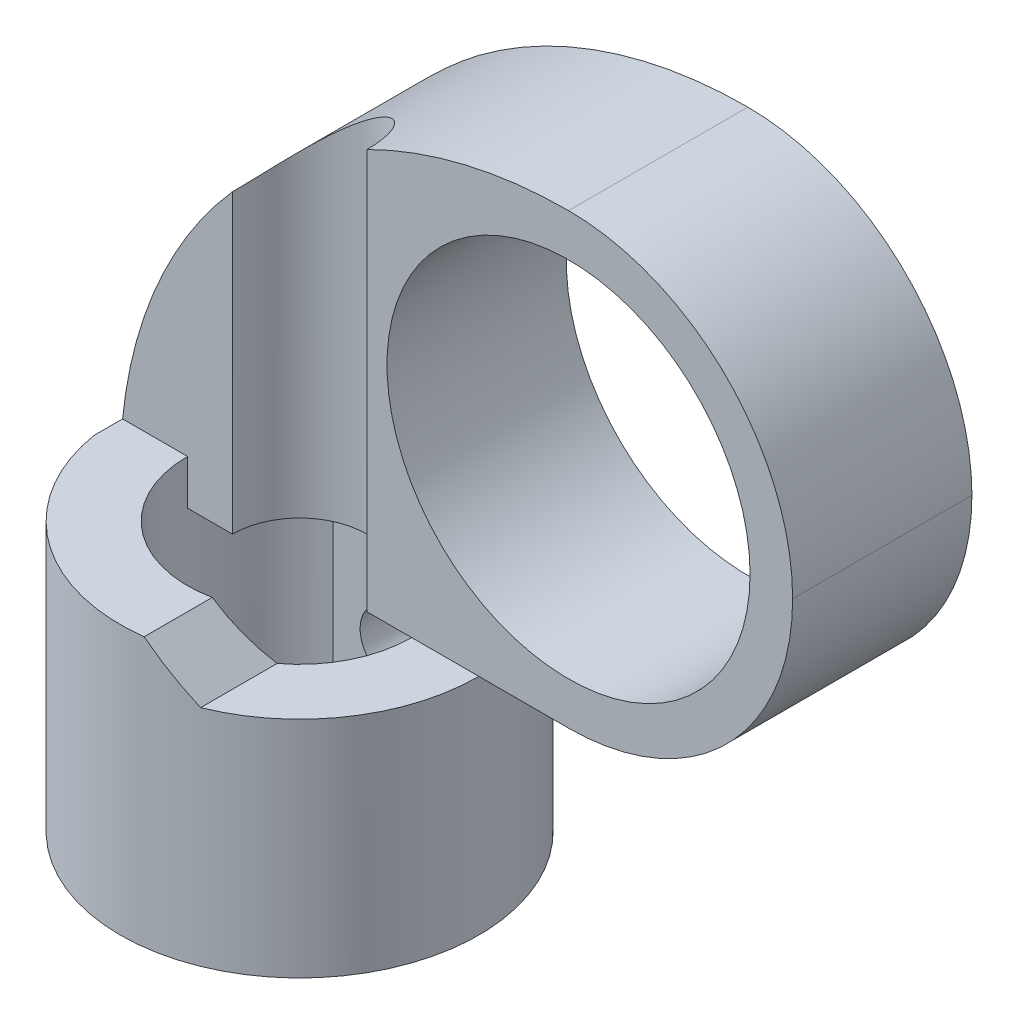
ISO-10303-21;
HEADER;
FILE_DESCRIPTION(('STEP AP214'),'2;1');
FILE_NAME('part.step','',(''),(''),'','','');
FILE_SCHEMA(('AUTOMOTIVE_DESIGN { 1 0 10303 214 1 1 1 1 }'));
ENDSEC;
DATA;
#1=APPLICATION_CONTEXT('core data for automotive mechanical design processes');
#2=APPLICATION_PROTOCOL_DEFINITION('international standard','automotive_design',2000,#1);
#3=PRODUCT_CONTEXT('',#1,'mechanical');
#4=PRODUCT('Part','Part','',(#3));
#5=PRODUCT_RELATED_PRODUCT_CATEGORY('part','',(#4));
#6=PRODUCT_DEFINITION_FORMATION('','',#4);
#7=PRODUCT_DEFINITION_CONTEXT('part definition',#1,'design');
#8=PRODUCT_DEFINITION('design','',#6,#7);
#9=PRODUCT_DEFINITION_SHAPE('','',#8);
#10=(LENGTH_UNIT() NAMED_UNIT(*) SI_UNIT(.MILLI.,.METRE.));
#11=(NAMED_UNIT(*) PLANE_ANGLE_UNIT() SI_UNIT($,.RADIAN.));
#12=(NAMED_UNIT(*) SI_UNIT($,.STERADIAN.) SOLID_ANGLE_UNIT());
#13=UNCERTAINTY_MEASURE_WITH_UNIT(LENGTH_MEASURE(1.E-05),#10,'distance_accuracy_value','');
#14=(GEOMETRIC_REPRESENTATION_CONTEXT(3) GLOBAL_UNCERTAINTY_ASSIGNED_CONTEXT((#13)) GLOBAL_UNIT_ASSIGNED_CONTEXT((#10,
#11,#12)) REPRESENTATION_CONTEXT('',''));
#15=CARTESIAN_POINT('',(0.,0.,0.));
#16=DIRECTION('',(0.,0.,1.));
#17=DIRECTION('',(1.,0.,0.));
#18=AXIS2_PLACEMENT_3D('',#15,#16,#17);
#19=CARTESIAN_POINT('',(0.,6.,0.));
#20=DIRECTION('',(0.,-1.,0.));
#21=DIRECTION('',(0.,0.,-1.));
#22=AXIS2_PLACEMENT_3D('',#19,#20,#21);
#23=CYLINDRICAL_SURFACE('',#22,4.);
#24=CARTESIAN_POINT('',(0.,3.25,-4.));
#25=CARTESIAN_POINT('',(0.0417358732327354,3.24999840520586,-3.99999924416926));
#26=CARTESIAN_POINT('',(0.0834924963650493,3.24650446169031,-3.99934004960857));
#27=CARTESIAN_POINT('',(0.165829064920899,3.23263000244083,-3.9967739294526));
#28=CARTESIAN_POINT('',(0.206407987076113,3.22224367468013,-3.99486595083448));
#29=CARTESIAN_POINT('',(0.285186480925901,3.19491364937033,-3.99001569382729));
#30=CARTESIAN_POINT('',(0.323388165342672,3.17797587377373,-3.98707434973241));
#31=CARTESIAN_POINT('',(0.396403986547003,3.13804056153859,-3.98047855299892));
#32=CARTESIAN_POINT('',(0.431218397238662,3.11504351542759,-3.97682415809145));
#33=CARTESIAN_POINT('',(0.496891857965252,3.06335011599816,-3.96915668215252));
#34=CARTESIAN_POINT('',(0.527704477515917,3.03459527766493,-3.96514017428176));
#35=CARTESIAN_POINT('',(0.584098030676847,2.97232834545622,-3.95722659229325));
#36=CARTESIAN_POINT('',(0.609678588446208,2.93881591011536,-3.95332952677264));
#37=CARTESIAN_POINT('',(0.655074993328965,2.86765695581802,-3.94606275622503));
#38=CARTESIAN_POINT('',(0.674843609848027,2.82997981484138,-3.94269746943091));
#39=CARTESIAN_POINT('',(0.707752621661416,2.75176554241161,-3.93692356605994));
#40=CARTESIAN_POINT('',(0.720893588565492,2.71122865794439,-3.93451486698481));
#41=CARTESIAN_POINT('',(0.740025267517502,2.6289423845428,-3.93096134787275));
#42=CARTESIAN_POINT('',(0.746096950960196,2.58721245139827,-3.92980222683202));
#43=CARTESIAN_POINT('',(0.751169040476733,2.50331130759588,-3.92883598576381));
#44=CARTESIAN_POINT('',(0.750170080676872,2.46114013684885,-3.9290287444938));
#45=CARTESIAN_POINT('',(0.741194898011814,2.37814023736698,-3.93073146350876));
#46=CARTESIAN_POINT('',(0.733310749980226,2.33730114284992,-3.93222404073667));
#47=CARTESIAN_POINT('',(0.710933996981037,2.2575357901087,-3.93633091642333));
#48=CARTESIAN_POINT('',(0.696441111197499,2.21860961324535,-3.93894526254758));
#49=CARTESIAN_POINT('',(0.661168235896501,2.14350566049987,-3.94501927646294));
#50=CARTESIAN_POINT('',(0.640351067662281,2.1073457647096,-3.94848391911683));
#51=CARTESIAN_POINT('',(0.593046844652084,2.03899763572989,-3.95586485801459));
#52=CARTESIAN_POINT('',(0.566559214446332,2.0068098061426,-3.95978120007761));
#53=CARTESIAN_POINT('',(0.508169528426491,1.94678752216377,-3.96770000636082));
#54=CARTESIAN_POINT('',(0.476188718430344,1.91902967377413,-3.97170285512015));
#55=CARTESIAN_POINT('',(0.407984018549416,1.8692613796623,-3.97928693054159));
#56=CARTESIAN_POINT('',(0.371760086127887,1.84725099156479,-3.98286815297622));
#57=CARTESIAN_POINT('',(0.296017494437337,1.80959112306499,-3.98921269838754));
#58=CARTESIAN_POINT('',(0.25649478222325,1.79394961044105,-3.99197499568144));
#59=CARTESIAN_POINT('',(0.175319557699351,1.76954895345392,-3.9963625270136));
#60=CARTESIAN_POINT('',(0.133667272138897,1.76078907797732,-3.99798788183997));
#61=CARTESIAN_POINT('',(0.0500743264516956,1.75050698449087,-3.9999018032099));
#62=CARTESIAN_POINT('',(0.00814700631707065,1.74887980423514,-4.00020975456139));
#63=CARTESIAN_POINT('',(-0.075380624046089,1.75262773977382,-3.99950771799114));
#64=CARTESIAN_POINT('',(-0.11698095024019,1.75800251153263,-3.99849779482216));
#65=CARTESIAN_POINT('',(-0.198340786609106,1.77551451759168,-3.99528555750203));
#66=CARTESIAN_POINT('',(-0.238112130523029,1.78759864126891,-3.99309261187015));
#67=CARTESIAN_POINT('',(-0.315064315912313,1.81812885338939,-3.98775921106249));
#68=CARTESIAN_POINT('',(-0.352244981297549,1.83657537378289,-3.98461869155667));
#69=CARTESIAN_POINT('',(-0.423408335756604,1.87953906407976,-3.97769015178833));
#70=CARTESIAN_POINT('',(-0.457351638507558,1.90412036926842,-3.97389543087281));
#71=CARTESIAN_POINT('',(-0.52066916163227,1.95856906868118,-3.96609671744856));
#72=CARTESIAN_POINT('',(-0.550042954880431,1.98843695650066,-3.96209270542344));
#73=CARTESIAN_POINT('',(-0.603786479360237,2.05308615945571,-3.95426237848725));
#74=CARTESIAN_POINT('',(-0.62808458109288,2.08792745406269,-3.95043912930129));
#75=CARTESIAN_POINT('',(-0.670483375288932,2.16125881226187,-3.94346492789266));
#76=CARTESIAN_POINT('',(-0.688584298069618,2.19974874018524,-3.94031395068675));
#77=CARTESIAN_POINT('',(-0.717973367564113,2.27910293362127,-3.93506512104787));
#78=CARTESIAN_POINT('',(-0.729294343973929,2.31995468977967,-3.93296220218439));
#79=CARTESIAN_POINT('',(-0.744903396631175,2.4030236112607,-3.93003601901208));
#80=CARTESIAN_POINT('',(-0.749192266353539,2.4452406219852,-3.92921261032895));
#81=CARTESIAN_POINT('',(-0.750588810741772,2.52912416572075,-3.92894599901929));
#82=CARTESIAN_POINT('',(-0.747809475017493,2.5707887904785,-3.92948107987147));
#83=CARTESIAN_POINT('',(-0.735395876894013,2.65304571102264,-3.93182300329999));
#84=CARTESIAN_POINT('',(-0.725761655446659,2.69363801321372,-3.93362983827873));
#85=CARTESIAN_POINT('',(-0.699959437916315,2.77253724239774,-3.9383025401159));
#86=CARTESIAN_POINT('',(-0.683803676986261,2.81084829567288,-3.94116642297482));
#87=CARTESIAN_POINT('',(-0.64542934456102,2.88423412712042,-3.9476319377592));
#88=CARTESIAN_POINT('',(-0.623210344740927,2.91930867642239,-3.9512336218006));
#89=CARTESIAN_POINT('',(-0.572947436697675,2.98579184002115,-3.95883633053873));
#90=CARTESIAN_POINT('',(-0.544821299321517,3.01713770628355,-3.96284252676522));
#91=CARTESIAN_POINT('',(-0.483713963371145,3.07470258123226,-3.97076416959368));
#92=CARTESIAN_POINT('',(-0.450731650945807,3.10092041049007,-3.97467959513664));
#93=CARTESIAN_POINT('',(-0.380492472535936,3.14770547631353,-3.98201987984024));
#94=CARTESIAN_POINT('',(-0.343199795320258,3.16821971424532,-3.9854400049528));
#95=CARTESIAN_POINT('',(-0.265645056826917,3.20265881830257,-3.99135809690343));
#96=CARTESIAN_POINT('',(-0.225385825852624,3.21658987352345,-3.99385692939519));
#97=CARTESIAN_POINT('',(-0.154173601412577,3.23463865720934,-3.99714145353816));
#98=CARTESIAN_POINT('',(-0.123636905125935,3.2403893151564,-3.99820735439103));
#99=CARTESIAN_POINT('',(-0.0620706235575788,3.24807053105822,-3.99963689977005));
#100=CARTESIAN_POINT('',(-0.0310410508263547,3.25000118612795,-4.00000056214902));
#101=CARTESIAN_POINT('',(0.,3.25,-4.));
#102=B_SPLINE_CURVE_WITH_KNOTS('',3,(#24,#25,#26,#27,#28,#29,#30,#31,#32,#33,#34,#35,#36,#37,
#38,#39,#40,#41,#42,#43,#44,#45,#46,#47,#48,#49,#50,#51,#52,#53,#54,#55,#56,#57,#58,#59,#60,#61,
#62,#63,#64,#65,#66,#67,#68,#69,#70,#71,#72,#73,#74,#75,#76,#77,#78,#79,#80,#81,#82,#83,#84,#85,
#86,#87,#88,#89,#90,#91,#92,#93,#94,#95,#96,#97,#98,#99,#100,#101),.UNSPECIFIED.,.T.,.F.,(4,2,2,
2,2,2,2,2,2,2,2,2,2,2,2,2,2,2,2,2,2,2,2,2,2,2,2,2,2,2,2,2,2,2,2,2,2,2,4),(0.,0.125094100482462,
0.250293821267726,0.375380635615453,0.500457326684454,0.626875590068153,0.753302931418083,
0.880730952521788,1.00814798155974,1.13409075722668,1.26002223793628,1.38429500306383,
1.50857304923393,1.63359631314765,1.7586322702493,1.88563884232038,2.01264668772474,
2.13981294160849,2.26696568336873,2.39224087038048,2.51750990232292,2.64180116953914,
2.76610087669016,2.89175889008854,3.01742864206549,3.14476718493649,3.27210099477472,
3.39881313909279,3.52551098473256,3.65019626115874,3.77488079270753,3.89933248103846,
4.02379296327711,4.1501168498319,4.27646975631128,4.40396024458157,4.53133063465586,
4.62437172262204,4.7174104451977),.UNSPECIFIED.);
#103=CARTESIAN_POINT('',(0.,3.25,-4.));
#104=VERTEX_POINT('',#103);
#105=EDGE_CURVE('E237',#104,#104,#102,.T.);
#106=ORIENTED_EDGE('',*,*,#105,.F.);
#107=EDGE_LOOP('',(#106));
#108=FACE_BOUND('',#107,.T.);
#109=CARTESIAN_POINT('',(0.,0.,0.));
#110=DIRECTION('',(0.,1.,0.));
#111=DIRECTION('',(0.,0.,1.));
#112=AXIS2_PLACEMENT_3D('',#109,#110,#111);
#113=CIRCLE('',#112,4.);
#114=CARTESIAN_POINT('',(0.,0.,4.));
#115=VERTEX_POINT('',#114);
#116=EDGE_CURVE('E193',#115,#115,#113,.T.);
#117=ORIENTED_EDGE('',*,*,#116,.T.);
#118=EDGE_LOOP('',(#117));
#119=FACE_BOUND('',#118,.T.);
#120=CARTESIAN_POINT('',(0.,5.,0.));
#121=DIRECTION('',(0.,1.,0.));
#122=DIRECTION('',(0.,0.,1.));
#123=AXIS2_PLACEMENT_3D('',#120,#121,#122);
#124=CIRCLE('',#123,4.);
#125=CARTESIAN_POINT('',(1.5,5.,3.70809924354783));
#126=VERTEX_POINT('',#125);
#127=CARTESIAN_POINT('',(4.,5.,0.));
#128=VERTEX_POINT('',#127);
#129=EDGE_CURVE('E134',#126,#128,#124,.T.);
#130=ORIENTED_EDGE('',*,*,#129,.F.);
#131=CARTESIAN_POINT('',(0.,6.5,0.));
#132=DIRECTION('',(-0.707106781186549,-0.707106781186546,0.));
#133=DIRECTION('',(0.707106781186546,-0.707106781186549,0.));
#134=AXIS2_PLACEMENT_3D('',#131,#132,#133);
#135=ELLIPSE('',#134,5.65685424949239,4.);
#136=CARTESIAN_POINT('',(0.5,6.,3.96862696659689));
#137=VERTEX_POINT('',#136);
#138=EDGE_CURVE('E11',#126,#137,#135,.T.);
#139=ORIENTED_EDGE('',*,*,#138,.T.);
#140=CARTESIAN_POINT('',(0.,6.,0.));
#141=DIRECTION('',(0.,1.,0.));
#142=DIRECTION('',(0.,0.,1.));
#143=AXIS2_PLACEMENT_3D('',#140,#141,#142);
#144=CIRCLE('',#143,4.);
#145=CARTESIAN_POINT('',(-3.9498743710662,6.,0.631262586246322));
#146=VERTEX_POINT('',#145);
#147=EDGE_CURVE('E194',#146,#137,#144,.T.);
#148=ORIENTED_EDGE('',*,*,#147,.F.);
#149=CARTESIAN_POINT('',(-3.9498743710662,6.,0.631262586246322));
#150=CARTESIAN_POINT('',(-3.96632277253755,5.83630392232504,0.528319356862075));
#151=CARTESIAN_POINT('',(-3.97871575402529,5.6724313521736,0.424975405116243));
#152=CARTESIAN_POINT('',(-3.99540519007638,5.34466869147848,0.217982730391228));
#153=CARTESIAN_POINT('',(-3.9997087743698,5.18077874380114,0.114334356507499));
#154=CARTESIAN_POINT('',(-3.99999523603248,5.01126870686564,0.00712695582297911));
#155=CARTESIAN_POINT('',(-3.99999999779557,5.00563434305114,0.00356347116541067));
#156=CARTESIAN_POINT('',(-4.,5.,0.));
#157=B_SPLINE_CURVE_WITH_KNOTS('',3,(#149,#150,#151,#152,#153,#154,#155,#156),.UNSPECIFIED.,.F.,
.F.,(4,2,2,4),(0.,0.582212443825408,1.16391150360277,1.18391150870536),.UNSPECIFIED.);
#158=CARTESIAN_POINT('',(-4.,5.,0.));
#159=VERTEX_POINT('',#158);
#160=EDGE_CURVE('E214',#146,#159,#157,.T.);
#161=ORIENTED_EDGE('',*,*,#160,.T.);
#162=CARTESIAN_POINT('',(0.,13.,-4.));
#163=CARTESIAN_POINT('',(-0.136828142349666,12.8974163205105,-3.9999865045483));
#164=CARTESIAN_POINT('',(-0.270883349009091,12.7913558223817,-3.99298316514078));
#165=CARTESIAN_POINT('',(-0.532473742800881,12.573345536025,-3.96657821674277));
#166=CARTESIAN_POINT('',(-0.660019795246988,12.4614062401594,-3.9471980508367));
#167=CARTESIAN_POINT('',(-0.90691673449115,12.2334307682533,-3.89784569202083));
#168=CARTESIAN_POINT('',(-1.02633399292208,12.1174436459312,-3.86797592672533));
#169=CARTESIAN_POINT('',(-1.2579962205929,11.8810530718573,-3.79895536855165));
#170=CARTESIAN_POINT('',(-1.37023693747521,11.7606470670557,-3.75979913664154));
#171=CARTESIAN_POINT('',(-1.63335273219341,11.4642196545002,-3.65511218402422));
#172=CARTESIAN_POINT('',(-1.78042089668579,11.2862713975694,-3.58543920262987));
#173=CARTESIAN_POINT('',(-2.05941788108904,10.9243595245275,-3.43279691235437));
#174=CARTESIAN_POINT('',(-2.19134288412687,10.7403944067991,-3.34982426383159));
#175=CARTESIAN_POINT('',(-2.44098896225458,10.3666096422533,-3.17256045263293));
#176=CARTESIAN_POINT('',(-2.55862453171194,10.1767625402299,-3.07820730054449));
#177=CARTESIAN_POINT('',(-2.77917552112438,9.79322689449993,-2.880642470672));
#178=CARTESIAN_POINT('',(-2.88209066491544,9.59953827880181,-2.77743062675168));
#179=CARTESIAN_POINT('',(-3.11335424297583,9.12812428449467,-2.51956723914358));
#180=CARTESIAN_POINT('',(-3.23456273387307,8.84884356889938,-2.36132688702443));
#181=CARTESIAN_POINT('',(-3.44956780619618,8.28580891102368,-2.03439818807636));
#182=CARTESIAN_POINT('',(-3.543350883079,8.00205283726669,-1.86570474342132));
#183=CARTESIAN_POINT('',(-3.70425021344949,7.43208484915114,-1.52137047053106));
#184=CARTESIAN_POINT('',(-3.77141934042668,7.14587896988863,-1.34574418718945));
#185=CARTESIAN_POINT('',(-3.88003973098983,6.57166812426913,-0.989887224920112));
#186=CARTESIAN_POINT('',(-3.92150459798406,6.28366419115204,-0.809659034125393));
#187=CARTESIAN_POINT('',(-3.96664690227575,5.83231316445596,-0.525804465514074));
#188=CARTESIAN_POINT('',(-3.97891607459805,5.66926692083749,-0.422978469644746));
#189=CARTESIAN_POINT('',(-3.99544488881155,5.34310856296169,-0.216995930114278));
#190=CARTESIAN_POINT('',(-3.99971005306622,5.17999657184071,-0.113839663582856));
#191=CARTESIAN_POINT('',(-3.99999523753145,5.01126870148945,-0.0071269525611572));
#192=CARTESIAN_POINT('',(-3.99999999934633,5.00563433748219,-0.00356346779445476));
#193=CARTESIAN_POINT('',(-4.,4.99999999999999,0.));
#194=B_SPLINE_CURVE_WITH_KNOTS('',3,(#162,#163,#164,#165,#166,#167,#168,#169,#170,#171,#172,
#173,#174,#175,#176,#177,#178,#179,#180,#181,#182,#183,#184,#185,#186,#187,#188,#189,#190,#191,
#192,#193),.UNSPECIFIED.,.F.,.F.,(4,2,2,2,2,2,2,2,2,2,2,2,2,2,2,4),(0.,0.512646840224081,
1.02440791078159,1.53130471589305,2.03849914404044,2.76083094309587,3.48334440980876,
4.20998802285531,4.93664526638483,5.96450394794211,6.99286790824439,8.01917846622402,
9.04494540740961,9.62426733753744,10.2031894174716,10.2231894225741),.UNSPECIFIED.);
#195=CARTESIAN_POINT('',(0.,13.,-4.));
#196=VERTEX_POINT('',#195);
#197=EDGE_CURVE('E270',#159,#196,#194,.F.);
#198=ORIENTED_EDGE('',*,*,#197,.T.);
#199=DIRECTION('',(0.,-1.,0.));
#200=VECTOR('',#199,1.);
#201=CARTESIAN_POINT('',(0.,15.,-4.));
#202=LINE('',#201,#200);
#203=CARTESIAN_POINT('',(0.,5.,-4.));
#204=VERTEX_POINT('',#203);
#205=EDGE_CURVE('E170',#196,#204,#202,.T.);
#206=ORIENTED_EDGE('',*,*,#205,.T.);
#207=CARTESIAN_POINT('',(0.,5.,0.));
#208=DIRECTION('',(0.,1.,0.));
#209=DIRECTION('',(-1.,0.,0.));
#210=AXIS2_PLACEMENT_3D('',#207,#208,#209);
#211=CIRCLE('',#210,4.);
#212=EDGE_CURVE('E162',#128,#204,#211,.T.);
#213=ORIENTED_EDGE('',*,*,#212,.F.);
#214=EDGE_LOOP('',(#130,#139,#148,#161,#198,#206,#213));
#215=FACE_BOUND('',#214,.T.);
#216=ADVANCED_FACE('F38',(#108,#119,#215),#23,.T.);
#217=CARTESIAN_POINT('',(0.,6.,0.));
#218=DIRECTION('',(0.,-1.,0.));
#219=DIRECTION('',(0.,0.,-1.));
#220=AXIS2_PLACEMENT_3D('',#217,#218,#219);
#221=CYLINDRICAL_SURFACE('',#220,2.5);
#222=CARTESIAN_POINT('',(0.,6.,0.));
#223=DIRECTION('',(0.,1.,0.));
#224=DIRECTION('',(0.,0.,1.));
#225=AXIS2_PLACEMENT_3D('',#222,#223,#224);
#226=CIRCLE('',#225,2.5);
#227=CARTESIAN_POINT('',(-2.5,6.,0.));
#228=VERTEX_POINT('',#227);
#229=CARTESIAN_POINT('',(0.5,6.,2.44948974278318));
#230=VERTEX_POINT('',#229);
#231=EDGE_CURVE('E181',#228,#230,#226,.T.);
#232=ORIENTED_EDGE('',*,*,#231,.T.);
#233=CARTESIAN_POINT('',(0.,6.5,0.));
#234=DIRECTION('',(-0.707106781186549,-0.707106781186546,0.));
#235=DIRECTION('',(0.707106781186546,-0.707106781186549,0.));
#236=AXIS2_PLACEMENT_3D('',#233,#234,#235);
#237=ELLIPSE('',#236,3.53553390593274,2.5);
#238=CARTESIAN_POINT('',(1.5,5.,2.));
#239=VERTEX_POINT('',#238);
#240=EDGE_CURVE('E46',#230,#239,#237,.F.);
#241=ORIENTED_EDGE('',*,*,#240,.T.);
#242=CARTESIAN_POINT('',(0.,5.,0.));
#243=DIRECTION('',(0.,1.,0.));
#244=DIRECTION('',(0.,0.,1.));
#245=AXIS2_PLACEMENT_3D('',#242,#243,#244);
#246=CIRCLE('',#245,2.5);
#247=CARTESIAN_POINT('',(2.5,5.,0.));
#248=VERTEX_POINT('',#247);
#249=EDGE_CURVE('E143',#239,#248,#246,.T.);
#250=ORIENTED_EDGE('',*,*,#249,.T.);
#251=CARTESIAN_POINT('',(0.,5.,0.));
#252=DIRECTION('',(0.,1.,0.));
#253=DIRECTION('',(-1.,0.,0.));
#254=AXIS2_PLACEMENT_3D('',#251,#252,#253);
#255=CIRCLE('',#254,2.5);
#256=CARTESIAN_POINT('',(1.35646599662505,5.,-2.1));
#257=VERTEX_POINT('',#256);
#258=EDGE_CURVE('E172',#248,#257,#255,.T.);
#259=ORIENTED_EDGE('',*,*,#258,.T.);
#260=DIRECTION('',(0.,-1.,0.));
#261=VECTOR('',#260,1.);
#262=CARTESIAN_POINT('',(1.35646599662505,6.,-2.1));
#263=LINE('',#262,#261);
#264=CARTESIAN_POINT('',(1.35646599662505,0.,-2.1));
#265=VERTEX_POINT('',#264);
#266=EDGE_CURVE('E191',#257,#265,#263,.T.);
#267=ORIENTED_EDGE('',*,*,#266,.T.);
#268=CARTESIAN_POINT('',(0.,0.,0.));
#269=DIRECTION('',(0.,1.,0.));
#270=DIRECTION('',(0.,0.,1.));
#271=AXIS2_PLACEMENT_3D('',#268,#269,#270);
#272=CIRCLE('',#271,2.5);
#273=CARTESIAN_POINT('',(-1.35646599662505,0.,-2.1));
#274=VERTEX_POINT('',#273);
#275=EDGE_CURVE('E174',#274,#265,#272,.T.);
#276=ORIENTED_EDGE('',*,*,#275,.F.);
#277=DIRECTION('',(0.,-1.,0.));
#278=VECTOR('',#277,1.);
#279=CARTESIAN_POINT('',(-1.35646599662505,6.,-2.1));
#280=LINE('',#279,#278);
#281=CARTESIAN_POINT('',(-1.35646599662505,5.,-2.1));
#282=VERTEX_POINT('',#281);
#283=EDGE_CURVE('E184',#282,#274,#280,.T.);
#284=ORIENTED_EDGE('',*,*,#283,.F.);
#285=CARTESIAN_POINT('',(-2.5,5.,0.));
#286=VERTEX_POINT('',#285);
#287=EDGE_CURVE('E177',#282,#286,#255,.T.);
#288=ORIENTED_EDGE('',*,*,#287,.T.);
#289=DIRECTION('',(0.,-1.,0.));
#290=VECTOR('',#289,1.);
#291=CARTESIAN_POINT('',(-2.5,6.,0.));
#292=LINE('',#291,#290);
#293=EDGE_CURVE('E201',#228,#286,#292,.T.);
#294=ORIENTED_EDGE('',*,*,#293,.F.);
#295=EDGE_LOOP('',(#232,#241,#250,#259,#267,#276,#284,#288,#294));
#296=FACE_BOUND('',#295,.T.);
#297=ADVANCED_FACE('F231',(#296),#221,.F.);
#298=CARTESIAN_POINT('',(0.,6.,0.));
#299=DIRECTION('',(0.,1.,0.));
#300=DIRECTION('',(0.,0.,1.));
#301=AXIS2_PLACEMENT_3D('',#298,#299,#300);
#302=PLANE('',#301);
#303=ORIENTED_EDGE('',*,*,#147,.T.);
#304=DIRECTION('',(0.,0.,-1.));
#305=VECTOR('',#304,1.);
#306=CARTESIAN_POINT('',(0.5,6.,0.));
#307=LINE('',#306,#305);
#308=EDGE_CURVE('E269',#137,#230,#307,.T.);
#309=ORIENTED_EDGE('',*,*,#308,.T.);
#310=ORIENTED_EDGE('',*,*,#231,.F.);
#311=DIRECTION('',(1.,0.,0.));
#312=VECTOR('',#311,1.);
#313=CARTESIAN_POINT('',(0.,6.,0.));
#314=LINE('',#313,#312);
#315=CARTESIAN_POINT('',(-3.9498743710662,6.,0.));
#316=VERTEX_POINT('',#315);
#317=EDGE_CURVE('E171',#316,#228,#314,.T.);
#318=ORIENTED_EDGE('',*,*,#317,.F.);
#319=DIRECTION('',(0.,0.,-1.));
#320=VECTOR('',#319,1.);
#321=CARTESIAN_POINT('',(-3.9498743710662,6.,0.));
#322=LINE('',#321,#320);
#323=EDGE_CURVE('E212',#316,#146,#322,.F.);
#324=ORIENTED_EDGE('',*,*,#323,.T.);
#325=EDGE_LOOP('',(#303,#309,#310,#318,#324));
#326=FACE_BOUND('',#325,.T.);
#327=ADVANCED_FACE('F283',(#326),#302,.T.);
#328=CARTESIAN_POINT('',(0.,0.,0.));
#329=DIRECTION('',(0.,0.,1.));
#330=DIRECTION('',(1.,0.,0.));
#331=AXIS2_PLACEMENT_3D('',#328,#329,#330);
#332=PLANE('',#331);
#333=DIRECTION('',(0.,-1.,0.));
#334=VECTOR('',#333,1.);
#335=CARTESIAN_POINT('',(-1.5,15.,0.));
#336=LINE('',#335,#334);
#337=CARTESIAN_POINT('',(-1.5,11.6143782776615,0.));
#338=VERTEX_POINT('',#337);
#339=CARTESIAN_POINT('',(-1.5,5.,0.));
#340=VERTEX_POINT('',#339);
#341=EDGE_CURVE('E310',#338,#340,#336,.T.);
#342=ORIENTED_EDGE('',*,*,#341,.F.);
#343=CARTESIAN_POINT('',(6.,5.,0.));
#344=DIRECTION('',(0.,0.,1.));
#345=DIRECTION('',(1.,0.,0.));
#346=AXIS2_PLACEMENT_3D('',#343,#344,#345);
#347=CIRCLE('',#346,10.);
#348=EDGE_CURVE('E208',#338,#316,#347,.T.);
#349=ORIENTED_EDGE('',*,*,#348,.T.);
#350=ORIENTED_EDGE('',*,*,#317,.T.);
#351=ORIENTED_EDGE('',*,*,#293,.T.);
#352=DIRECTION('',(1.,0.,0.));
#353=VECTOR('',#352,1.);
#354=CARTESIAN_POINT('',(11.,5.,0.));
#355=LINE('',#354,#353);
#356=EDGE_CURVE('E168',#286,#340,#355,.T.);
#357=ORIENTED_EDGE('',*,*,#356,.T.);
#358=EDGE_LOOP('',(#342,#349,#350,#351,#357));
#359=FACE_BOUND('',#358,.T.);
#360=ADVANCED_FACE('F324',(#359),#332,.T.);
#361=CARTESIAN_POINT('',(-1.35646599662505,6.,-2.1));
#362=DIRECTION('',(0.,0.,1.));
#363=DIRECTION('',(1.,0.,0.));
#364=AXIS2_PLACEMENT_3D('',#361,#362,#363);
#365=PLANE('',#364);
#366=CARTESIAN_POINT('',(0.,2.5,-2.1));
#367=DIRECTION('',(0.,0.,1.));
#368=DIRECTION('',(1.,0.,0.));
#369=AXIS2_PLACEMENT_3D('',#366,#367,#368);
#370=CIRCLE('',#369,0.75);
#371=CARTESIAN_POINT('',(0.750000000000002,2.5,-2.1));
#372=VERTEX_POINT('',#371);
#373=EDGE_CURVE('E142',#372,#372,#370,.F.);
#374=ORIENTED_EDGE('',*,*,#373,.T.);
#375=EDGE_LOOP('',(#374));
#376=FACE_BOUND('',#375,.T.);
#377=ORIENTED_EDGE('',*,*,#266,.F.);
#378=DIRECTION('',(-1.,0.,0.));
#379=VECTOR('',#378,1.);
#380=CARTESIAN_POINT('',(-1.35646599662505,5.,-2.1));
#381=LINE('',#380,#379);
#382=EDGE_CURVE('E196',#257,#282,#381,.T.);
#383=ORIENTED_EDGE('',*,*,#382,.T.);
#384=ORIENTED_EDGE('',*,*,#283,.T.);
#385=DIRECTION('',(-1.,0.,0.));
#386=VECTOR('',#385,1.);
#387=CARTESIAN_POINT('',(-1.35646599662505,0.,-2.1));
#388=LINE('',#387,#386);
#389=EDGE_CURVE('E185',#265,#274,#388,.T.);
#390=ORIENTED_EDGE('',*,*,#389,.F.);
#391=EDGE_LOOP('',(#377,#383,#384,#390));
#392=FACE_BOUND('',#391,.T.);
#393=ADVANCED_FACE('F333',(#376,#392),#365,.T.);
#394=CARTESIAN_POINT('',(0.,0.,0.));
#395=DIRECTION('',(0.,1.,0.));
#396=DIRECTION('',(0.,0.,1.));
#397=AXIS2_PLACEMENT_3D('',#394,#395,#396);
#398=PLANE('',#397);
#399=ORIENTED_EDGE('',*,*,#116,.F.);
#400=EDGE_LOOP('',(#399));
#401=FACE_BOUND('',#400,.T.);
#402=ORIENTED_EDGE('',*,*,#275,.T.);
#403=ORIENTED_EDGE('',*,*,#389,.T.);
#404=EDGE_LOOP('',(#402,#403));
#405=FACE_BOUND('',#404,.T.);
#406=ADVANCED_FACE('F233',(#401,#405),#398,.F.);
#407=CARTESIAN_POINT('',(1.5,5.,0.));
#408=VERTEX_POINT('',#407);
#409=EDGE_CURVE('E154',#408,#248,#355,.T.);
#410=ORIENTED_EDGE('',*,*,#409,.T.);
#411=DIRECTION('',(1.,0.,0.));
#412=VECTOR('',#411,1.);
#413=CARTESIAN_POINT('',(4.,5.,0.));
#414=LINE('',#413,#412);
#415=EDGE_CURVE('E138',#248,#128,#414,.T.);
#416=ORIENTED_EDGE('',*,*,#415,.T.);
#417=CARTESIAN_POINT('',(6.,5.,0.));
#418=VERTEX_POINT('',#417);
#419=EDGE_CURVE('E151',#128,#418,#355,.T.);
#420=ORIENTED_EDGE('',*,*,#419,.T.);
#421=CARTESIAN_POINT('',(6.,10.,0.));
#422=DIRECTION('',(0.,0.,1.));
#423=DIRECTION('',(1.,0.,0.));
#424=AXIS2_PLACEMENT_3D('',#421,#422,#423);
#425=CIRCLE('',#424,5.);
#426=CARTESIAN_POINT('',(11.,10.,0.));
#427=VERTEX_POINT('',#426);
#428=EDGE_CURVE('E292',#418,#427,#425,.T.);
#429=ORIENTED_EDGE('',*,*,#428,.T.);
#430=CARTESIAN_POINT('',(6.,10.,0.));
#431=DIRECTION('',(0.,0.,1.));
#432=DIRECTION('',(1.,0.,0.));
#433=AXIS2_PLACEMENT_3D('',#430,#431,#432);
#434=CIRCLE('',#433,5.);
#435=CARTESIAN_POINT('',(6.,15.,0.));
#436=VERTEX_POINT('',#435);
#437=EDGE_CURVE('E293',#427,#436,#434,.T.);
#438=ORIENTED_EDGE('',*,*,#437,.T.);
#439=CARTESIAN_POINT('',(1.5,13.9302855497459,0.));
#440=VERTEX_POINT('',#439);
#441=EDGE_CURVE('E209',#436,#440,#347,.T.);
#442=ORIENTED_EDGE('',*,*,#441,.T.);
#443=DIRECTION('',(0.,-1.,0.));
#444=VECTOR('',#443,1.);
#445=CARTESIAN_POINT('',(1.5,15.,0.));
#446=LINE('',#445,#444);
#447=EDGE_CURVE('E244',#408,#440,#446,.F.);
#448=ORIENTED_EDGE('',*,*,#447,.F.);
#449=EDGE_LOOP('',(#410,#416,#420,#429,#438,#442,#448));
#450=FACE_BOUND('',#449,.T.);
#451=CARTESIAN_POINT('',(6.,10.,0.));
#452=DIRECTION('',(0.,0.,1.));
#453=DIRECTION('',(1.,0.,0.));
#454=AXIS2_PLACEMENT_3D('',#451,#452,#453);
#455=CIRCLE('',#454,4.05);
#456=CARTESIAN_POINT('',(10.05,10.,0.));
#457=VERTEX_POINT('',#456);
#458=EDGE_CURVE('E300',#457,#457,#455,.T.);
#459=ORIENTED_EDGE('',*,*,#458,.F.);
#460=EDGE_LOOP('',(#459));
#461=FACE_BOUND('',#460,.T.);
#462=ADVANCED_FACE('F149',(#450,#461),#332,.T.);
#463=CARTESIAN_POINT('',(11.,5.,0.));
#464=DIRECTION('',(0.,1.,0.));
#465=DIRECTION('',(-1.,0.,0.));
#466=AXIS2_PLACEMENT_3D('',#463,#464,#465);
#467=PLANE('',#466);
#468=DIRECTION('',(1.,0.,0.));
#469=VECTOR('',#468,1.);
#470=CARTESIAN_POINT('',(11.,5.,-4.));
#471=LINE('',#470,#469);
#472=CARTESIAN_POINT('',(6.,5.,-4.));
#473=VERTEX_POINT('',#472);
#474=EDGE_CURVE('E166',#204,#473,#471,.T.);
#475=ORIENTED_EDGE('',*,*,#474,.T.);
#476=DIRECTION('',(0.,0.,-1.));
#477=VECTOR('',#476,1.);
#478=CARTESIAN_POINT('',(6.,5.,0.));
#479=LINE('',#478,#477);
#480=EDGE_CURVE('E165',#473,#418,#479,.F.);
#481=ORIENTED_EDGE('',*,*,#480,.T.);
#482=ORIENTED_EDGE('',*,*,#419,.F.);
#483=ORIENTED_EDGE('',*,*,#212,.T.);
#484=EDGE_LOOP('',(#475,#481,#482,#483));
#485=FACE_BOUND('',#484,.T.);
#486=ADVANCED_FACE('F161',(#485),#467,.F.);
#487=ORIENTED_EDGE('',*,*,#409,.F.);
#488=CARTESIAN_POINT('',(0.,5.,0.));
#489=DIRECTION('',(0.,1.,0.));
#490=DIRECTION('',(-1.,0.,0.));
#491=AXIS2_PLACEMENT_3D('',#488,#489,#490);
#492=CIRCLE('',#491,1.5);
#493=EDGE_CURVE('E307',#408,#340,#492,.T.);
#494=ORIENTED_EDGE('',*,*,#493,.T.);
#495=ORIENTED_EDGE('',*,*,#356,.F.);
#496=ORIENTED_EDGE('',*,*,#287,.F.);
#497=ORIENTED_EDGE('',*,*,#382,.F.);
#498=ORIENTED_EDGE('',*,*,#258,.F.);
#499=EDGE_LOOP('',(#487,#494,#495,#496,#497,#498));
#500=FACE_BOUND('',#499,.T.);
#501=ADVANCED_FACE('F330',(#500),#467,.F.);
#502=CARTESIAN_POINT('',(0.,0.,-4.));
#503=DIRECTION('',(0.,0.,1.));
#504=DIRECTION('',(1.,0.,0.));
#505=AXIS2_PLACEMENT_3D('',#502,#503,#504);
#506=PLANE('',#505);
#507=CARTESIAN_POINT('',(6.,10.,-4.));
#508=DIRECTION('',(0.,0.,1.));
#509=DIRECTION('',(1.,0.,0.));
#510=AXIS2_PLACEMENT_3D('',#507,#508,#509);
#511=CIRCLE('',#510,4.05);
#512=CARTESIAN_POINT('',(10.05,10.,-4.));
#513=VERTEX_POINT('',#512);
#514=EDGE_CURVE('E305',#513,#513,#511,.T.);
#515=ORIENTED_EDGE('',*,*,#514,.T.);
#516=EDGE_LOOP('',(#515));
#517=FACE_BOUND('',#516,.T.);
#518=ORIENTED_EDGE('',*,*,#474,.F.);
#519=ORIENTED_EDGE('',*,*,#205,.F.);
#520=CARTESIAN_POINT('',(6.,5.,-4.));
#521=DIRECTION('',(0.,0.,1.));
#522=DIRECTION('',(1.,0.,0.));
#523=AXIS2_PLACEMENT_3D('',#520,#521,#522);
#524=CIRCLE('',#523,10.);
#525=CARTESIAN_POINT('',(6.,15.,-4.));
#526=VERTEX_POINT('',#525);
#527=EDGE_CURVE('E203',#196,#526,#524,.F.);
#528=ORIENTED_EDGE('',*,*,#527,.T.);
#529=CARTESIAN_POINT('',(6.,10.,-4.));
#530=DIRECTION('',(0.,0.,1.));
#531=DIRECTION('',(1.,0.,0.));
#532=AXIS2_PLACEMENT_3D('',#529,#530,#531);
#533=CIRCLE('',#532,5.);
#534=CARTESIAN_POINT('',(11.,10.,-4.));
#535=VERTEX_POINT('',#534);
#536=EDGE_CURVE('E223',#526,#535,#533,.F.);
#537=ORIENTED_EDGE('',*,*,#536,.T.);
#538=CARTESIAN_POINT('',(6.,10.,-4.));
#539=DIRECTION('',(0.,0.,1.));
#540=DIRECTION('',(1.,0.,0.));
#541=AXIS2_PLACEMENT_3D('',#538,#539,#540);
#542=CIRCLE('',#541,5.);
#543=EDGE_CURVE('E315',#535,#473,#542,.F.);
#544=ORIENTED_EDGE('',*,*,#543,.T.);
#545=EDGE_LOOP('',(#518,#519,#528,#537,#544));
#546=FACE_BOUND('',#545,.T.);
#547=ADVANCED_FACE('F317',(#517,#546),#506,.F.);
#548=CARTESIAN_POINT('',(6.,10.,-4.));
#549=DIRECTION('',(0.,0.,1.));
#550=DIRECTION('',(1.,0.,0.));
#551=AXIS2_PLACEMENT_3D('',#548,#549,#550);
#552=CYLINDRICAL_SURFACE('',#551,4.05);
#553=ORIENTED_EDGE('',*,*,#514,.F.);
#554=EDGE_LOOP('',(#553));
#555=FACE_BOUND('',#554,.T.);
#556=ORIENTED_EDGE('',*,*,#458,.T.);
#557=EDGE_LOOP('',(#556));
#558=FACE_BOUND('',#557,.T.);
#559=ADVANCED_FACE('F379',(#555,#558),#552,.F.);
#560=CARTESIAN_POINT('',(6.,5.,0.));
#561=DIRECTION('',(0.,0.,-1.));
#562=DIRECTION('',(-1.,0.,0.));
#563=AXIS2_PLACEMENT_3D('',#560,#561,#562);
#564=CYLINDRICAL_SURFACE('',#563,10.);
#565=CARTESIAN_POINT('',(1.34746164482671,13.8517730909486,0.6590501617638));
#566=CARTESIAN_POINT('',(1.3638405116231,13.8603813325651,0.625564840930619));
#567=CARTESIAN_POINT('',(1.37903094565329,13.8683081873461,0.591339740046965));
#568=CARTESIAN_POINT('',(1.40689568320122,13.8827721154699,0.521590095588166));
#569=CARTESIAN_POINT('',(1.41956957834198,13.8893089632583,0.48606534221489));
#570=CARTESIAN_POINT('',(1.4535763030817,13.9067779014724,0.377904141559826));
#571=CARTESIAN_POINT('',(1.47092907625937,13.9155865377174,0.303609816576838));
#572=CARTESIAN_POINT('',(1.49416280403399,13.9273514287829,0.152712631322223));
#573=CARTESIAN_POINT('',(1.50002680356005,13.9302990340205,0.0761065282530577));
#574=CARTESIAN_POINT('',(1.49997304442522,13.9302719888573,-0.0770649858226824));
#575=CARTESIAN_POINT('',(1.49406232329962,13.9273008759661,-0.153630393793785));
#576=CARTESIAN_POINT('',(1.47092450436669,13.9155839006488,-0.303375463870463));
#577=CARTESIAN_POINT('',(1.45386908302581,13.9069256345366,-0.376588741659311));
#578=CARTESIAN_POINT('',(1.40936829351503,13.8840712110905,-0.518884165085727));
#579=CARTESIAN_POINT('',(1.38191973699341,13.8698733543091,-0.58796503546667));
#580=CARTESIAN_POINT('',(1.31709739442015,13.8358239771667,-0.721733064110309));
#581=CARTESIAN_POINT('',(1.27952035810275,13.815855997639,-0.786291673155558));
#582=CARTESIAN_POINT('',(1.19628088037985,13.7707763678961,-0.907936242062397));
#583=CARTESIAN_POINT('',(1.1506175085304,13.7456641257106,-0.965021340677869));
#584=CARTESIAN_POINT('',(1.04946109432198,13.6888291178425,-1.07450786534398));
#585=CARTESIAN_POINT('',(0.993503991721032,13.6567669050913,-1.12630269767511));
#586=CARTESIAN_POINT('',(0.876293766843078,13.587913508091,-1.21972721454446));
#587=CARTESIAN_POINT('',(0.81503845355598,13.5511203643332,-1.26135266618283));
#588=CARTESIAN_POINT('',(0.681637915650917,13.4688757099594,-1.3386538387066));
#589=CARTESIAN_POINT('',(0.609062185445553,13.4229148378917,-1.37304093313891));
#590=CARTESIAN_POINT('',(0.4618488766851,13.326861728027,-1.42930620964578));
#591=CARTESIAN_POINT('',(0.387210135241651,13.2767671271675,-1.45117717934804));
#592=CARTESIAN_POINT('',(0.225687868423969,13.1650732159126,-1.48557361369924));
#593=CARTESIAN_POINT('',(0.138754801294888,13.1029151353558,-1.4960454855704));
#594=CARTESIAN_POINT('',(-0.0333579396957669,12.9755927617855,-1.50210252788695));
#595=CARTESIAN_POINT('',(-0.118537015386521,12.9104274669843,-1.49768270166098));
#596=CARTESIAN_POINT('',(-0.299831234289433,12.7670867759099,-1.47303689896065));
#597=CARTESIAN_POINT('',(-0.395340777913141,12.6885844905904,-1.45024918710588));
#598=CARTESIAN_POINT('',(-0.580137003177532,12.5310402224312,-1.38672863818358));
#599=CARTESIAN_POINT('',(-0.669409388341068,12.4519974280371,-1.34595604567742));
#600=CARTESIAN_POINT('',(-0.801499391230942,12.3310083582613,-1.26907393092066));
#601=CARTESIAN_POINT('',(-0.84722058428704,12.288297829637,-1.23904986278232));
#602=CARTESIAN_POINT('',(-0.935791953653435,12.204064482784,-1.17359729193887));
#603=CARTESIAN_POINT('',(-0.978641014089007,12.1625421297322,-1.13816670602169));
#604=CARTESIAN_POINT('',(-1.10200668297465,12.0409252370373,-1.02378064254746));
#605=CARTESIAN_POINT('',(-1.17781524722301,11.9633426524102,-0.936462480403114));
#606=CARTESIAN_POINT('',(-1.27959588574806,11.8563964844042,-0.785246576625852));
#607=CARTESIAN_POINT('',(-1.31224189211468,11.8215115458555,-0.729638322179554));
#608=CARTESIAN_POINT('',(-1.37110401927696,11.7578607855749,-0.611873797207136));
#609=CARTESIAN_POINT('',(-1.39733079117271,11.7290848381842,-0.549728621468217));
#610=CARTESIAN_POINT('',(-1.43806621328417,11.6840066019807,-0.430402414173734));
#611=CARTESIAN_POINT('',(-1.45380146216058,11.6664226702859,-0.374131495579732));
#612=CARTESIAN_POINT('',(-1.47875157644145,11.6384207995902,-0.258428929397664));
#613=CARTESIAN_POINT('',(-1.48797169842714,11.6279970837226,-0.198999871607028));
#614=CARTESIAN_POINT('',(-1.4991882239485,11.615304525885,-0.078264722906554));
#615=CARTESIAN_POINT('',(-1.50114741051731,11.6130776986379,-0.0169505812474339));
#616=CARTESIAN_POINT('',(-1.49755513131625,11.6171498905275,0.10517226659443));
#617=CARTESIAN_POINT('',(-1.49200262825413,11.6234500871644,0.165980901804825));
#618=CARTESIAN_POINT('',(-1.47460005721933,11.643079469218,0.280437638032029));
#619=CARTESIAN_POINT('',(-1.46327950406945,11.6558170042626,0.334272809041047));
#620=CARTESIAN_POINT('',(-1.43539789164464,11.6869492702616,0.438817972243967));
#621=CARTESIAN_POINT('',(-1.41883571026675,11.7053452125173,0.489527292490813));
#622=CARTESIAN_POINT('',(-1.38405093706975,11.7436162106605,0.579997944482545));
#623=CARTESIAN_POINT('',(-1.36644526487725,11.7628605479102,0.620263576101669));
#624=CARTESIAN_POINT('',(-1.34746164482696,11.7834215096659,0.659050161763975));
#625=B_SPLINE_CURVE_WITH_KNOTS('',3,(#565,#566,#567,#568,#569,#570,#571,#572,#573,#574,#575,
#576,#577,#578,#579,#580,#581,#582,#583,#584,#585,#586,#587,#588,#589,#590,#591,#592,#593,#594,
#595,#596,#597,#598,#599,#600,#601,#602,#603,#604,#605,#606,#607,#608,#609,#610,#611,#612,#613,
#614,#615,#616,#617,#618,#619,#620,#621,#622,#623,#624),.UNSPECIFIED.,.F.,.F.,(4,2,2,2,2,2,2,2,
2,2,2,2,2,2,2,2,2,2,2,2,2,2,2,2,2,2,2,2,2,4),(0.,0.114709618972654,0.229437837519416,
0.458653941516657,0.688208067364548,0.91762503407138,1.14358875241326,1.3696218469614,
1.6005805185918,1.83156578247744,2.07870214396388,2.32594119881754,2.60246351487343,
2.87914501589136,3.20006872452014,3.521100124694,3.89676124439124,4.27325695424998,
4.48118555353998,4.68919447408035,5.10314348094217,5.32247646393463,5.54144301379954,
5.72375965906545,5.90592903783353,6.08903087062073,6.2721579905947,6.44088562180477,
6.60964939788784,6.75322079915278),.UNSPECIFIED.);
#626=EDGE_CURVE('E262',#440,#338,#625,.T.);
#627=ORIENTED_EDGE('',*,*,#626,.F.);
#628=ORIENTED_EDGE('',*,*,#441,.F.);
#629=DIRECTION('',(0.,0.,-1.));
#630=VECTOR('',#629,1.);
#631=CARTESIAN_POINT('',(6.,15.,0.));
#632=LINE('',#631,#630);
#633=EDGE_CURVE('E205',#526,#436,#632,.F.);
#634=ORIENTED_EDGE('',*,*,#633,.F.);
#635=ORIENTED_EDGE('',*,*,#527,.F.);
#636=ORIENTED_EDGE('',*,*,#197,.F.);
#637=ORIENTED_EDGE('',*,*,#160,.F.);
#638=ORIENTED_EDGE('',*,*,#323,.F.);
#639=ORIENTED_EDGE('',*,*,#348,.F.);
#640=EDGE_LOOP('',(#627,#628,#634,#635,#636,#637,#638,#639));
#641=FACE_BOUND('',#640,.T.);
#642=ADVANCED_FACE('F225',(#641),#564,.T.);
#643=CARTESIAN_POINT('',(6.,10.,0.));
#644=DIRECTION('',(0.,0.,-1.));
#645=DIRECTION('',(-1.,0.,0.));
#646=AXIS2_PLACEMENT_3D('',#643,#644,#645);
#647=CYLINDRICAL_SURFACE('',#646,5.);
#648=ORIENTED_EDGE('',*,*,#633,.T.);
#649=ORIENTED_EDGE('',*,*,#437,.F.);
#650=DIRECTION('',(0.,0.,-1.));
#651=VECTOR('',#650,1.);
#652=CARTESIAN_POINT('',(11.,10.,0.));
#653=LINE('',#652,#651);
#654=EDGE_CURVE('E298',#535,#427,#653,.F.);
#655=ORIENTED_EDGE('',*,*,#654,.F.);
#656=ORIENTED_EDGE('',*,*,#536,.F.);
#657=EDGE_LOOP('',(#648,#649,#655,#656));
#658=FACE_BOUND('',#657,.T.);
#659=ADVANCED_FACE('F319',(#658),#647,.T.);
#660=CARTESIAN_POINT('',(6.,10.,0.));
#661=DIRECTION('',(0.,0.,-1.));
#662=DIRECTION('',(-1.,0.,0.));
#663=AXIS2_PLACEMENT_3D('',#660,#661,#662);
#664=CYLINDRICAL_SURFACE('',#663,5.);
#665=ORIENTED_EDGE('',*,*,#428,.F.);
#666=ORIENTED_EDGE('',*,*,#480,.F.);
#667=ORIENTED_EDGE('',*,*,#543,.F.);
#668=ORIENTED_EDGE('',*,*,#654,.T.);
#669=EDGE_LOOP('',(#665,#666,#667,#668));
#670=FACE_BOUND('',#669,.T.);
#671=ADVANCED_FACE('F257',(#670),#664,.T.);
#672=CARTESIAN_POINT('',(0.,15.,0.));
#673=DIRECTION('',(0.,-1.,0.));
#674=DIRECTION('',(0.,0.,-1.));
#675=AXIS2_PLACEMENT_3D('',#672,#673,#674);
#676=CYLINDRICAL_SURFACE('',#675,1.5);
#677=ORIENTED_EDGE('',*,*,#447,.T.);
#678=ORIENTED_EDGE('',*,*,#626,.T.);
#679=ORIENTED_EDGE('',*,*,#341,.T.);
#680=ORIENTED_EDGE('',*,*,#493,.F.);
#681=EDGE_LOOP('',(#677,#678,#679,#680));
#682=FACE_BOUND('',#681,.T.);
#683=ADVANCED_FACE('F252',(#682),#676,.F.);
#684=CARTESIAN_POINT('',(0.,2.5,-1.));
#685=DIRECTION('',(0.,0.,-1.));
#686=DIRECTION('',(-1.,0.,0.));
#687=AXIS2_PLACEMENT_3D('',#684,#685,#686);
#688=CYLINDRICAL_SURFACE('',#687,0.75);
#689=ORIENTED_EDGE('',*,*,#373,.F.);
#690=EDGE_LOOP('',(#689));
#691=FACE_BOUND('',#690,.T.);
#692=ORIENTED_EDGE('',*,*,#105,.T.);
#693=EDGE_LOOP('',(#692));
#694=FACE_BOUND('',#693,.T.);
#695=ADVANCED_FACE('F247',(#691,#694),#688,.F.);
#696=CARTESIAN_POINT('',(4.,5.,4.));
#697=DIRECTION('',(0.,1.,0.));
#698=DIRECTION('',(0.,0.,1.));
#699=AXIS2_PLACEMENT_3D('',#696,#697,#698);
#700=PLANE('',#699);
#701=ORIENTED_EDGE('',*,*,#129,.T.);
#702=ORIENTED_EDGE('',*,*,#415,.F.);
#703=ORIENTED_EDGE('',*,*,#249,.F.);
#704=DIRECTION('',(0.,0.,-1.));
#705=VECTOR('',#704,1.);
#706=CARTESIAN_POINT('',(1.5,5.,4.));
#707=LINE('',#706,#705);
#708=EDGE_CURVE('E140',#126,#239,#707,.T.);
#709=ORIENTED_EDGE('',*,*,#708,.F.);
#710=EDGE_LOOP('',(#701,#702,#703,#709));
#711=FACE_BOUND('',#710,.T.);
#712=ADVANCED_FACE('F136',(#711),#700,.T.);
#713=CARTESIAN_POINT('',(0.5,6.,0.));
#714=DIRECTION('',(-0.707106781186549,-0.707106781186546,0.));
#715=DIRECTION('',(0.,0.,-1.));
#716=AXIS2_PLACEMENT_3D('',#713,#714,#715);
#717=PLANE('',#716);
#718=ORIENTED_EDGE('',*,*,#138,.F.);
#719=ORIENTED_EDGE('',*,*,#708,.T.);
#720=ORIENTED_EDGE('',*,*,#240,.F.);
#721=ORIENTED_EDGE('',*,*,#308,.F.);
#722=EDGE_LOOP('',(#718,#719,#720,#721));
#723=FACE_BOUND('',#722,.T.);
#724=ADVANCED_FACE('F40',(#723),#717,.F.);
#725=CLOSED_SHELL('',(#216,#297,#327,#360,#393,#406,#462,#486,#501,#547,#559,#642,#659,#671,
#683,#695,#712,#724));
#726=MANIFOLD_SOLID_BREP('B2',#725);
#727=ADVANCED_BREP_SHAPE_REPRESENTATION('',(#18,#726),#14);
#728=SHAPE_DEFINITION_REPRESENTATION(#9,#727);
ENDSEC;
END-ISO-10303-21;
